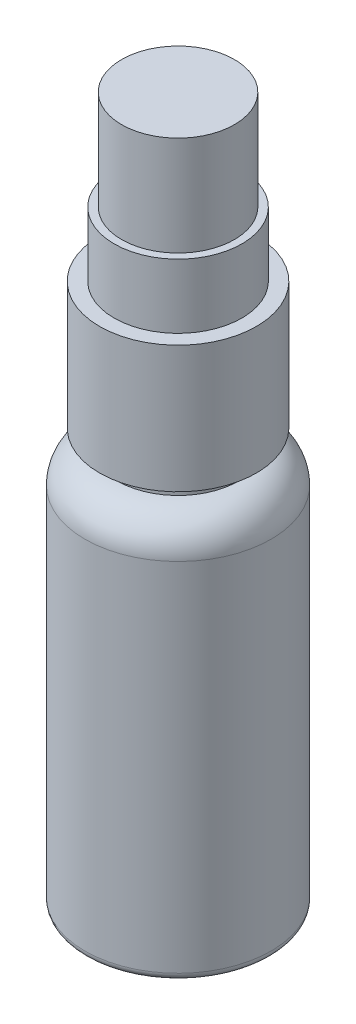
ISO-10303-21;
HEADER;
FILE_DESCRIPTION(('STEP AP214'),'2;1');
FILE_NAME('part.step','',(''),(''),'','','');
FILE_SCHEMA(('AUTOMOTIVE_DESIGN { 1 0 10303 214 1 1 1 1 }'));
ENDSEC;
DATA;
#1=APPLICATION_CONTEXT('core data for automotive mechanical design processes');
#2=APPLICATION_PROTOCOL_DEFINITION('international standard','automotive_design',2000,#1);
#3=PRODUCT_CONTEXT('',#1,'mechanical');
#4=PRODUCT('Part','Part','',(#3));
#5=PRODUCT_RELATED_PRODUCT_CATEGORY('part','',(#4));
#6=PRODUCT_DEFINITION_FORMATION('','',#4);
#7=PRODUCT_DEFINITION_CONTEXT('part definition',#1,'design');
#8=PRODUCT_DEFINITION('design','',#6,#7);
#9=PRODUCT_DEFINITION_SHAPE('','',#8);
#10=(LENGTH_UNIT() NAMED_UNIT(*) SI_UNIT(.MILLI.,.METRE.));
#11=(NAMED_UNIT(*) PLANE_ANGLE_UNIT() SI_UNIT($,.RADIAN.));
#12=(NAMED_UNIT(*) SI_UNIT($,.STERADIAN.) SOLID_ANGLE_UNIT());
#13=UNCERTAINTY_MEASURE_WITH_UNIT(LENGTH_MEASURE(1.E-05),#10,'distance_accuracy_value','');
#14=(GEOMETRIC_REPRESENTATION_CONTEXT(3) GLOBAL_UNCERTAINTY_ASSIGNED_CONTEXT((#13)) GLOBAL_UNIT_ASSIGNED_CONTEXT((#10,
#11,#12)) REPRESENTATION_CONTEXT('',''));
#15=CARTESIAN_POINT('',(0.,0.,0.));
#16=DIRECTION('',(0.,0.,1.));
#17=DIRECTION('',(1.,0.,0.));
#18=AXIS2_PLACEMENT_3D('',#15,#16,#17);
#19=CARTESIAN_POINT('',(7.5,50.875,0.));
#20=DIRECTION('',(0.,1.,0.));
#21=DIRECTION('',(0.,0.,1.));
#22=AXIS2_PLACEMENT_3D('',#19,#20,#21);
#23=PLANE('',#22);
#24=CARTESIAN_POINT('',(0.,50.875,0.));
#25=DIRECTION('',(0.,1.,0.));
#26=DIRECTION('',(0.,0.,1.));
#27=AXIS2_PLACEMENT_3D('',#24,#25,#26);
#28=CIRCLE('',#27,7.75);
#29=CARTESIAN_POINT('',(0.,50.875,7.75));
#30=VERTEX_POINT('',#29);
#31=EDGE_CURVE('E10',#30,#30,#28,.T.);
#32=ORIENTED_EDGE('',*,*,#31,.F.);
#33=EDGE_LOOP('',(#32));
#34=FACE_BOUND('',#33,.T.);
#35=CARTESIAN_POINT('',(0.,50.875,0.));
#36=DIRECTION('',(0.,1.,0.));
#37=DIRECTION('',(0.,0.,1.));
#38=AXIS2_PLACEMENT_3D('',#35,#36,#37);
#39=CIRCLE('',#38,7.5);
#40=CARTESIAN_POINT('',(0.,50.875,7.5));
#41=VERTEX_POINT('',#40);
#42=EDGE_CURVE('E87',#41,#41,#39,.T.);
#43=ORIENTED_EDGE('',*,*,#42,.T.);
#44=EDGE_LOOP('',(#43));
#45=FACE_BOUND('',#44,.T.);
#46=ADVANCED_FACE('F35',(#34,#45),#23,.F.);
#47=CARTESIAN_POINT('',(0.,65.8,0.));
#48=DIRECTION('',(0.,1.,0.));
#49=DIRECTION('',(0.,0.,1.));
#50=AXIS2_PLACEMENT_3D('',#47,#48,#49);
#51=CYLINDRICAL_SURFACE('',#50,7.75);
#52=CARTESIAN_POINT('',(0.,52.875,0.));
#53=DIRECTION('',(0.,1.,0.));
#54=DIRECTION('',(0.,0.,1.));
#55=AXIS2_PLACEMENT_3D('',#52,#53,#54);
#56=CIRCLE('',#55,7.75);
#57=CARTESIAN_POINT('',(0.,52.875,7.75));
#58=VERTEX_POINT('',#57);
#59=EDGE_CURVE('E41',#58,#58,#56,.T.);
#60=ORIENTED_EDGE('',*,*,#59,.F.);
#61=EDGE_LOOP('',(#60));
#62=FACE_BOUND('',#61,.T.);
#63=ORIENTED_EDGE('',*,*,#31,.T.);
#64=EDGE_LOOP('',(#63));
#65=FACE_BOUND('',#64,.T.);
#66=ADVANCED_FACE('F128',(#62,#65),#51,.T.);
#67=CARTESIAN_POINT('',(7.75,52.875,0.));
#68=DIRECTION('',(0.,1.,0.));
#69=DIRECTION('',(0.,0.,1.));
#70=AXIS2_PLACEMENT_3D('',#67,#68,#69);
#71=PLANE('',#70);
#72=CARTESIAN_POINT('',(0.,52.875,0.));
#73=DIRECTION('',(0.,1.,0.));
#74=DIRECTION('',(0.,0.,1.));
#75=AXIS2_PLACEMENT_3D('',#72,#73,#74);
#76=CIRCLE('',#75,10.);
#77=CARTESIAN_POINT('',(0.,52.875,10.));
#78=VERTEX_POINT('',#77);
#79=EDGE_CURVE('E45',#78,#78,#76,.T.);
#80=ORIENTED_EDGE('',*,*,#79,.F.);
#81=EDGE_LOOP('',(#80));
#82=FACE_BOUND('',#81,.T.);
#83=ORIENTED_EDGE('',*,*,#59,.T.);
#84=EDGE_LOOP('',(#83));
#85=FACE_BOUND('',#84,.T.);
#86=ADVANCED_FACE('F133',(#82,#85),#71,.F.);
#87=CARTESIAN_POINT('',(0.,65.8,0.));
#88=DIRECTION('',(0.,1.,0.));
#89=DIRECTION('',(0.,0.,1.));
#90=AXIS2_PLACEMENT_3D('',#87,#88,#89);
#91=CYLINDRICAL_SURFACE('',#90,10.);
#92=CARTESIAN_POINT('',(0.,69.075,0.));
#93=DIRECTION('',(0.,1.,0.));
#94=DIRECTION('',(0.,0.,1.));
#95=AXIS2_PLACEMENT_3D('',#92,#93,#94);
#96=CIRCLE('',#95,10.);
#97=CARTESIAN_POINT('',(0.,69.075,10.));
#98=VERTEX_POINT('',#97);
#99=EDGE_CURVE('E49',#98,#98,#96,.T.);
#100=ORIENTED_EDGE('',*,*,#99,.F.);
#101=EDGE_LOOP('',(#100));
#102=FACE_BOUND('',#101,.T.);
#103=ORIENTED_EDGE('',*,*,#79,.T.);
#104=EDGE_LOOP('',(#103));
#105=FACE_BOUND('',#104,.T.);
#106=ADVANCED_FACE('F138',(#102,#105),#91,.T.);
#107=CARTESIAN_POINT('',(10.,69.075,0.));
#108=DIRECTION('',(0.,-1.,0.));
#109=DIRECTION('',(0.,0.,-1.));
#110=AXIS2_PLACEMENT_3D('',#107,#108,#109);
#111=PLANE('',#110);
#112=CARTESIAN_POINT('',(0.,69.075,0.));
#113=DIRECTION('',(0.,1.,0.));
#114=DIRECTION('',(0.,0.,1.));
#115=AXIS2_PLACEMENT_3D('',#112,#113,#114);
#116=CIRCLE('',#115,8.15);
#117=CARTESIAN_POINT('',(0.,69.075,8.15));
#118=VERTEX_POINT('',#117);
#119=EDGE_CURVE('E54',#118,#118,#116,.T.);
#120=ORIENTED_EDGE('',*,*,#119,.F.);
#121=EDGE_LOOP('',(#120));
#122=FACE_BOUND('',#121,.T.);
#123=ORIENTED_EDGE('',*,*,#99,.T.);
#124=EDGE_LOOP('',(#123));
#125=FACE_BOUND('',#124,.T.);
#126=ADVANCED_FACE('F144',(#122,#125),#111,.F.);
#127=CARTESIAN_POINT('',(0.,65.8,0.));
#128=DIRECTION('',(0.,1.,0.));
#129=DIRECTION('',(0.,0.,1.));
#130=AXIS2_PLACEMENT_3D('',#127,#128,#129);
#131=CYLINDRICAL_SURFACE('',#130,8.15);
#132=CARTESIAN_POINT('',(0.,77.275,0.));
#133=DIRECTION('',(0.,1.,0.));
#134=DIRECTION('',(0.,0.,1.));
#135=AXIS2_PLACEMENT_3D('',#132,#133,#134);
#136=CIRCLE('',#135,8.15);
#137=CARTESIAN_POINT('',(0.,77.275,8.15));
#138=VERTEX_POINT('',#137);
#139=EDGE_CURVE('E57',#138,#138,#136,.T.);
#140=ORIENTED_EDGE('',*,*,#139,.F.);
#141=EDGE_LOOP('',(#140));
#142=FACE_BOUND('',#141,.T.);
#143=ORIENTED_EDGE('',*,*,#119,.T.);
#144=EDGE_LOOP('',(#143));
#145=FACE_BOUND('',#144,.T.);
#146=ADVANCED_FACE('F148',(#142,#145),#131,.T.);
#147=CARTESIAN_POINT('',(8.15,77.275,0.));
#148=DIRECTION('',(0.,-1.,0.));
#149=DIRECTION('',(0.,0.,-1.));
#150=AXIS2_PLACEMENT_3D('',#147,#148,#149);
#151=PLANE('',#150);
#152=CARTESIAN_POINT('',(0.,77.275,0.));
#153=DIRECTION('',(0.,1.,0.));
#154=DIRECTION('',(0.,0.,1.));
#155=AXIS2_PLACEMENT_3D('',#152,#153,#154);
#156=CIRCLE('',#155,7.2);
#157=CARTESIAN_POINT('',(0.,77.275,7.2));
#158=VERTEX_POINT('',#157);
#159=EDGE_CURVE('E60',#158,#158,#156,.T.);
#160=ORIENTED_EDGE('',*,*,#159,.F.);
#161=EDGE_LOOP('',(#160));
#162=FACE_BOUND('',#161,.T.);
#163=ORIENTED_EDGE('',*,*,#139,.T.);
#164=EDGE_LOOP('',(#163));
#165=FACE_BOUND('',#164,.T.);
#166=ADVANCED_FACE('F152',(#162,#165),#151,.F.);
#167=CARTESIAN_POINT('',(0.,65.8,0.));
#168=DIRECTION('',(0.,1.,0.));
#169=DIRECTION('',(0.,0.,1.));
#170=AXIS2_PLACEMENT_3D('',#167,#168,#169);
#171=CYLINDRICAL_SURFACE('',#170,7.2);
#172=CARTESIAN_POINT('',(0.,89.975,0.));
#173=DIRECTION('',(0.,1.,0.));
#174=DIRECTION('',(0.,0.,1.));
#175=AXIS2_PLACEMENT_3D('',#172,#173,#174);
#176=CIRCLE('',#175,7.2);
#177=CARTESIAN_POINT('',(0.,89.975,7.2));
#178=VERTEX_POINT('',#177);
#179=EDGE_CURVE('E63',#178,#178,#176,.T.);
#180=ORIENTED_EDGE('',*,*,#179,.F.);
#181=EDGE_LOOP('',(#180));
#182=FACE_BOUND('',#181,.T.);
#183=ORIENTED_EDGE('',*,*,#159,.T.);
#184=EDGE_LOOP('',(#183));
#185=FACE_BOUND('',#184,.T.);
#186=ADVANCED_FACE('F156',(#182,#185),#171,.T.);
#187=CARTESIAN_POINT('',(0.,89.975,0.));
#188=DIRECTION('',(0.,1.,0.));
#189=DIRECTION('',(0.,0.,1.));
#190=AXIS2_PLACEMENT_3D('',#187,#188,#189);
#191=PLANE('',#190);
#192=ORIENTED_EDGE('',*,*,#179,.T.);
#193=EDGE_LOOP('',(#192));
#194=FACE_BOUND('',#193,.T.);
#195=ADVANCED_FACE('F160',(#194),#191,.T.);
#196=CARTESIAN_POINT('',(7.75,2.40955855165527,0.));
#197=DIRECTION('',(0.,-1.,0.));
#198=DIRECTION('',(0.,0.,-1.));
#199=AXIS2_PLACEMENT_3D('',#196,#197,#198);
#200=PLANE('',#199);
#201=CARTESIAN_POINT('',(0.,2.40955855165527,0.));
#202=DIRECTION('',(0.,1.,0.));
#203=DIRECTION('',(0.,0.,1.));
#204=AXIS2_PLACEMENT_3D('',#201,#202,#203);
#205=CIRCLE('',#204,7.75);
#206=CARTESIAN_POINT('',(0.,2.40955855165527,7.75));
#207=VERTEX_POINT('',#206);
#208=EDGE_CURVE('E66',#207,#207,#205,.T.);
#209=ORIENTED_EDGE('',*,*,#208,.F.);
#210=EDGE_LOOP('',(#209));
#211=FACE_BOUND('',#210,.T.);
#212=ADVANCED_FACE('F164',(#211),#200,.T.);
#213=CARTESIAN_POINT('',(0.,1.40955855165527,0.));
#214=DIRECTION('',(0.,1.,0.));
#215=DIRECTION('',(0.,0.,1.));
#216=AXIS2_PLACEMENT_3D('',#213,#214,#215);
#217=TOROIDAL_SURFACE('',#216,7.75,1.);
#218=ORIENTED_EDGE('',*,*,#208,.T.);
#219=EDGE_LOOP('',(#218));
#220=FACE_BOUND('',#219,.T.);
#221=CARTESIAN_POINT('',(0.,1.40955855165527,0.));
#222=DIRECTION('',(0.,1.,0.));
#223=DIRECTION('',(0.,0.,1.));
#224=AXIS2_PLACEMENT_3D('',#221,#222,#223);
#225=CIRCLE('',#224,8.75);
#226=CARTESIAN_POINT('',(0.,1.40955855165527,8.75));
#227=VERTEX_POINT('',#226);
#228=EDGE_CURVE('E69',#227,#227,#225,.T.);
#229=ORIENTED_EDGE('',*,*,#228,.F.);
#230=EDGE_LOOP('',(#229));
#231=FACE_BOUND('',#230,.T.);
#232=ADVANCED_FACE('F124',(#220,#231),#217,.F.);
#233=CARTESIAN_POINT('',(0.,65.8,0.));
#234=DIRECTION('',(0.,1.,0.));
#235=DIRECTION('',(0.,0.,1.));
#236=AXIS2_PLACEMENT_3D('',#233,#234,#235);
#237=CYLINDRICAL_SURFACE('',#236,8.75);
#238=ORIENTED_EDGE('',*,*,#228,.T.);
#239=EDGE_LOOP('',(#238));
#240=FACE_BOUND('',#239,.T.);
#241=CARTESIAN_POINT('',(0.,1.,0.));
#242=DIRECTION('',(0.,1.,0.));
#243=DIRECTION('',(0.,0.,1.));
#244=AXIS2_PLACEMENT_3D('',#241,#242,#243);
#245=CIRCLE('',#244,8.75);
#246=CARTESIAN_POINT('',(0.,1.,8.75));
#247=VERTEX_POINT('',#246);
#248=EDGE_CURVE('E72',#247,#247,#245,.T.);
#249=ORIENTED_EDGE('',*,*,#248,.F.);
#250=EDGE_LOOP('',(#249));
#251=FACE_BOUND('',#250,.T.);
#252=ADVANCED_FACE('F118',(#240,#251),#237,.F.);
#253=CARTESIAN_POINT('',(0.,1.,0.));
#254=DIRECTION('',(0.,1.,0.));
#255=DIRECTION('',(0.,0.,1.));
#256=AXIS2_PLACEMENT_3D('',#253,#254,#255);
#257=TOROIDAL_SURFACE('',#256,9.75,1.);
#258=ORIENTED_EDGE('',*,*,#248,.T.);
#259=EDGE_LOOP('',(#258));
#260=FACE_BOUND('',#259,.T.);
#261=CARTESIAN_POINT('',(0.,0.,0.));
#262=DIRECTION('',(0.,1.,0.));
#263=DIRECTION('',(0.,0.,1.));
#264=AXIS2_PLACEMENT_3D('',#261,#262,#263);
#265=CIRCLE('',#264,9.75);
#266=CARTESIAN_POINT('',(0.,0.,9.75));
#267=VERTEX_POINT('',#266);
#268=EDGE_CURVE('E75',#267,#267,#265,.T.);
#269=ORIENTED_EDGE('',*,*,#268,.F.);
#270=EDGE_LOOP('',(#269));
#271=FACE_BOUND('',#270,.T.);
#272=ADVANCED_FACE('F113',(#260,#271),#257,.T.);
#273=CARTESIAN_POINT('',(9.75,0.,0.));
#274=DIRECTION('',(0.,1.,0.));
#275=DIRECTION('',(0.,0.,1.));
#276=AXIS2_PLACEMENT_3D('',#273,#274,#275);
#277=PLANE('',#276);
#278=CARTESIAN_POINT('',(0.,0.,0.));
#279=DIRECTION('',(0.,1.,0.));
#280=DIRECTION('',(0.,0.,1.));
#281=AXIS2_PLACEMENT_3D('',#278,#279,#280);
#282=CIRCLE('',#281,10.875);
#283=CARTESIAN_POINT('',(0.,0.,10.875));
#284=VERTEX_POINT('',#283);
#285=EDGE_CURVE('E78',#284,#284,#282,.T.);
#286=ORIENTED_EDGE('',*,*,#285,.F.);
#287=EDGE_LOOP('',(#286));
#288=FACE_BOUND('',#287,.T.);
#289=ORIENTED_EDGE('',*,*,#268,.T.);
#290=EDGE_LOOP('',(#289));
#291=FACE_BOUND('',#290,.T.);
#292=ADVANCED_FACE('F107',(#288,#291),#277,.F.);
#293=CARTESIAN_POINT('',(0.,1.,0.));
#294=DIRECTION('',(0.,1.,0.));
#295=DIRECTION('',(0.,0.,1.));
#296=AXIS2_PLACEMENT_3D('',#293,#294,#295);
#297=TOROIDAL_SURFACE('',#296,10.875,1.);
#298=CARTESIAN_POINT('',(0.,1.,0.));
#299=DIRECTION('',(0.,1.,0.));
#300=DIRECTION('',(0.,0.,1.));
#301=AXIS2_PLACEMENT_3D('',#298,#299,#300);
#302=CIRCLE('',#301,11.875);
#303=CARTESIAN_POINT('',(0.,1.,11.875));
#304=VERTEX_POINT('',#303);
#305=EDGE_CURVE('E81',#304,#304,#302,.T.);
#306=ORIENTED_EDGE('',*,*,#305,.F.);
#307=EDGE_LOOP('',(#306));
#308=FACE_BOUND('',#307,.T.);
#309=ORIENTED_EDGE('',*,*,#285,.T.);
#310=EDGE_LOOP('',(#309));
#311=FACE_BOUND('',#310,.T.);
#312=ADVANCED_FACE('F101',(#308,#311),#297,.T.);
#313=CARTESIAN_POINT('',(0.,65.8,0.));
#314=DIRECTION('',(0.,1.,0.));
#315=DIRECTION('',(0.,0.,1.));
#316=AXIS2_PLACEMENT_3D('',#313,#314,#315);
#317=CYLINDRICAL_SURFACE('',#316,11.875);
#318=CARTESIAN_POINT('',(0.,46.5,0.));
#319=DIRECTION('',(0.,1.,0.));
#320=DIRECTION('',(0.,0.,1.));
#321=AXIS2_PLACEMENT_3D('',#318,#319,#320);
#322=CIRCLE('',#321,11.875);
#323=CARTESIAN_POINT('',(0.,46.5,11.875));
#324=VERTEX_POINT('',#323);
#325=EDGE_CURVE('E84',#324,#324,#322,.T.);
#326=ORIENTED_EDGE('',*,*,#325,.F.);
#327=EDGE_LOOP('',(#326));
#328=FACE_BOUND('',#327,.T.);
#329=ORIENTED_EDGE('',*,*,#305,.T.);
#330=EDGE_LOOP('',(#329));
#331=FACE_BOUND('',#330,.T.);
#332=ADVANCED_FACE('F95',(#328,#331),#317,.T.);
#333=CARTESIAN_POINT('',(0.,46.5,0.));
#334=DIRECTION('',(0.,1.,0.));
#335=DIRECTION('',(0.,0.,1.));
#336=AXIS2_PLACEMENT_3D('',#333,#334,#335);
#337=TOROIDAL_SURFACE('',#336,7.5,4.375);
#338=ORIENTED_EDGE('',*,*,#42,.F.);
#339=EDGE_LOOP('',(#338));
#340=FACE_BOUND('',#339,.T.);
#341=ORIENTED_EDGE('',*,*,#325,.T.);
#342=EDGE_LOOP('',(#341));
#343=FACE_BOUND('',#342,.T.);
#344=ADVANCED_FACE('F92',(#340,#343),#337,.T.);
#345=CLOSED_SHELL('',(#46,#66,#86,#106,#126,#146,#166,#186,#195,#212,#232,#252,#272,#292,#312,
#332,#344));
#346=MANIFOLD_SOLID_BREP('B2',#345);
#347=ADVANCED_BREP_SHAPE_REPRESENTATION('',(#18,#346),#14);
#348=SHAPE_DEFINITION_REPRESENTATION(#9,#347);
ENDSEC;
END-ISO-10303-21;
